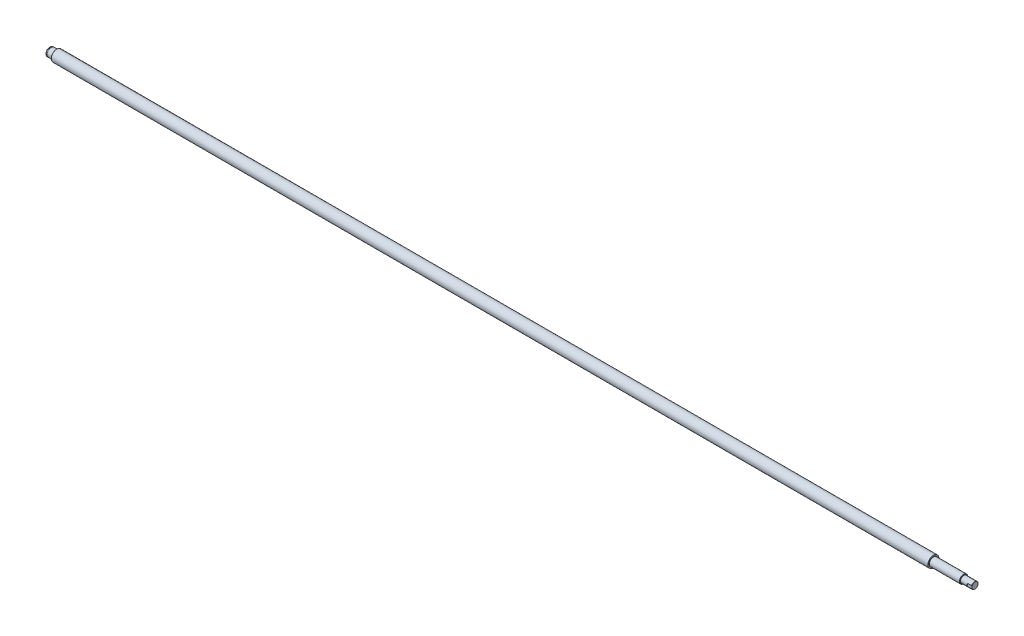
ISO-10303-21;
HEADER;
FILE_DESCRIPTION(('STEP AP214'),'2;1');
FILE_NAME('part.step','',(''),(''),'','','');
FILE_SCHEMA(('AUTOMOTIVE_DESIGN { 1 0 10303 214 1 1 1 1 }'));
ENDSEC;
DATA;
#1=APPLICATION_CONTEXT('core data for automotive mechanical design processes');
#2=APPLICATION_PROTOCOL_DEFINITION('international standard','automotive_design',2000,#1);
#3=PRODUCT_CONTEXT('',#1,'mechanical');
#4=PRODUCT('Part','Part','',(#3));
#5=PRODUCT_RELATED_PRODUCT_CATEGORY('part','',(#4));
#6=PRODUCT_DEFINITION_FORMATION('','',#4);
#7=PRODUCT_DEFINITION_CONTEXT('part definition',#1,'design');
#8=PRODUCT_DEFINITION('design','',#6,#7);
#9=PRODUCT_DEFINITION_SHAPE('','',#8);
#10=(LENGTH_UNIT() NAMED_UNIT(*) SI_UNIT(.MILLI.,.METRE.));
#11=(NAMED_UNIT(*) PLANE_ANGLE_UNIT() SI_UNIT($,.RADIAN.));
#12=(NAMED_UNIT(*) SI_UNIT($,.STERADIAN.) SOLID_ANGLE_UNIT());
#13=UNCERTAINTY_MEASURE_WITH_UNIT(LENGTH_MEASURE(1.E-05),#10,'distance_accuracy_value','');
#14=(GEOMETRIC_REPRESENTATION_CONTEXT(3) GLOBAL_UNCERTAINTY_ASSIGNED_CONTEXT((#13)) GLOBAL_UNIT_ASSIGNED_CONTEXT((#10,
#11,#12)) REPRESENTATION_CONTEXT('',''));
#15=CARTESIAN_POINT('',(0.,0.,0.));
#16=DIRECTION('',(0.,0.,1.));
#17=DIRECTION('',(1.,0.,0.));
#18=AXIS2_PLACEMENT_3D('',#15,#16,#17);
#19=CARTESIAN_POINT('',(0.,3.5,0.));
#20=DIRECTION('',(-1.,0.,0.));
#21=DIRECTION('',(0.,0.,1.));
#22=AXIS2_PLACEMENT_3D('',#19,#20,#21);
#23=PLANE('',#22);
#24=CARTESIAN_POINT('',(0.,0.,0.));
#25=DIRECTION('',(1.,0.,0.));
#26=DIRECTION('',(0.,0.,-1.));
#27=AXIS2_PLACEMENT_3D('',#24,#25,#26);
#28=CIRCLE('',#27,7.);
#29=CARTESIAN_POINT('',(0.,0.,-7.));
#30=VERTEX_POINT('',#29);
#31=EDGE_CURVE('E175',#30,#30,#28,.T.);
#32=ORIENTED_EDGE('',*,*,#31,.F.);
#33=EDGE_LOOP('',(#32));
#34=FACE_BOUND('',#33,.T.);
#35=ADVANCED_FACE('F17',(#34),#23,.T.);
#36=CARTESIAN_POINT('',(0.499999999999999,0.,0.));
#37=DIRECTION('',(1.,0.,0.));
#38=DIRECTION('',(0.,0.,-1.));
#39=AXIS2_PLACEMENT_3D('',#36,#37,#38);
#40=CONICAL_SURFACE('',#39,7.5,0.785398163397448);
#41=ORIENTED_EDGE('',*,*,#31,.T.);
#42=EDGE_LOOP('',(#41));
#43=FACE_BOUND('',#42,.T.);
#44=CARTESIAN_POINT('',(0.5,0.,0.));
#45=DIRECTION('',(1.,0.,0.));
#46=DIRECTION('',(0.,0.,-1.));
#47=AXIS2_PLACEMENT_3D('',#44,#45,#46);
#48=CIRCLE('',#47,7.5);
#49=CARTESIAN_POINT('',(0.5,0.,-7.5));
#50=VERTEX_POINT('',#49);
#51=EDGE_CURVE('E173',#50,#50,#48,.T.);
#52=ORIENTED_EDGE('',*,*,#51,.F.);
#53=EDGE_LOOP('',(#52));
#54=FACE_BOUND('',#53,.T.);
#55=ADVANCED_FACE('F208',(#43,#54),#40,.T.);
#56=CARTESIAN_POINT('',(1.17499999999984,0.,0.));
#57=DIRECTION('',(1.,0.,0.));
#58=DIRECTION('',(0.,0.,-1.));
#59=AXIS2_PLACEMENT_3D('',#56,#57,#58);
#60=CYLINDRICAL_SURFACE('',#59,7.5);
#61=ORIENTED_EDGE('',*,*,#51,.T.);
#62=EDGE_LOOP('',(#61));
#63=FACE_BOUND('',#62,.T.);
#64=CARTESIAN_POINT('',(1.84999999999968,0.,0.));
#65=DIRECTION('',(1.,0.,0.));
#66=DIRECTION('',(0.,0.,-1.));
#67=AXIS2_PLACEMENT_3D('',#64,#65,#66);
#68=CIRCLE('',#67,7.5);
#69=CARTESIAN_POINT('',(1.84999999999968,0.,-7.5));
#70=VERTEX_POINT('',#69);
#71=EDGE_CURVE('E89',#70,#70,#68,.T.);
#72=ORIENTED_EDGE('',*,*,#71,.F.);
#73=EDGE_LOOP('',(#72));
#74=FACE_BOUND('',#73,.T.);
#75=ADVANCED_FACE('F206',(#63,#74),#60,.T.);
#76=CARTESIAN_POINT('',(1670.,2.75,0.));
#77=DIRECTION('',(1.,0.,0.));
#78=DIRECTION('',(0.,0.,-1.));
#79=AXIS2_PLACEMENT_3D('',#76,#77,#78);
#80=PLANE('',#79);
#81=CARTESIAN_POINT('',(1670.00000000007,0.,0.));
#82=DIRECTION('',(-1.,0.,0.));
#83=DIRECTION('',(0.,0.,1.));
#84=AXIS2_PLACEMENT_3D('',#81,#82,#83);
#85=CIRCLE('',#84,5.49999999998363);
#86=CARTESIAN_POINT('',(1670.00000000006,0.,5.49999999999181));
#87=VERTEX_POINT('',#86);
#88=EDGE_CURVE('E73',#87,#87,#85,.T.);
#89=ORIENTED_EDGE('',*,*,#88,.F.);
#90=EDGE_LOOP('',(#89));
#91=FACE_BOUND('',#90,.T.);
#92=ADVANCED_FACE('F201',(#91),#80,.T.);
#93=CARTESIAN_POINT('',(1.84999999999984,7.325,0.));
#94=DIRECTION('',(1.,9.08479640721843E-13,0.));
#95=DIRECTION('',(-9.08479640721843E-13,1.,0.));
#96=AXIS2_PLACEMENT_3D('',#93,#94,#95);
#97=PLANE('',#96);
#98=CARTESIAN_POINT('',(1.85,0.,0.));
#99=DIRECTION('',(1.,0.,0.));
#100=DIRECTION('',(0.,0.,-1.));
#101=AXIS2_PLACEMENT_3D('',#98,#99,#100);
#102=CIRCLE('',#101,7.15);
#103=CARTESIAN_POINT('',(1.85,0.,-7.15));
#104=VERTEX_POINT('',#103);
#105=EDGE_CURVE('E80',#104,#104,#102,.T.);
#106=ORIENTED_EDGE('',*,*,#105,.F.);
#107=EDGE_LOOP('',(#106));
#108=FACE_BOUND('',#107,.T.);
#109=ORIENTED_EDGE('',*,*,#71,.T.);
#110=EDGE_LOOP('',(#109));
#111=FACE_BOUND('',#110,.T.);
#112=ADVANCED_FACE('F197',(#108,#111),#97,.T.);
#113=CARTESIAN_POINT('',(1662.,0.,0.));
#114=DIRECTION('',(1.,0.,0.));
#115=DIRECTION('',(0.,0.,-1.));
#116=AXIS2_PLACEMENT_3D('',#113,#114,#115);
#117=PLANE('',#116);
#118=CARTESIAN_POINT('',(1662.,0.,0.));
#119=DIRECTION('',(1.,0.,0.));
#120=DIRECTION('',(0.,0.,-1.));
#121=AXIS2_PLACEMENT_3D('',#118,#119,#120);
#122=CIRCLE('',#121,6.);
#123=CARTESIAN_POINT('',(1662.,-2.39791576165636,5.5));
#124=VERTEX_POINT('',#123);
#125=CARTESIAN_POINT('',(1662.,2.39791576165636,5.5));
#126=VERTEX_POINT('',#125);
#127=EDGE_CURVE('E170',#124,#126,#122,.F.);
#128=ORIENTED_EDGE('',*,*,#127,.F.);
#129=DIRECTION('',(0.,1.,0.));
#130=VECTOR('',#129,1.);
#131=CARTESIAN_POINT('',(1662.,-6.,5.5));
#132=LINE('',#131,#130);
#133=EDGE_CURVE('E86',#124,#126,#132,.T.);
#134=ORIENTED_EDGE('',*,*,#133,.T.);
#135=EDGE_LOOP('',(#128,#134));
#136=FACE_BOUND('',#135,.T.);
#137=ADVANCED_FACE('F200',(#136),#117,.T.);
#138=CARTESIAN_POINT('',(1670.,-6.,5.5));
#139=DIRECTION('',(0.,0.,-1.));
#140=DIRECTION('',(-1.,0.,0.));
#141=AXIS2_PLACEMENT_3D('',#138,#139,#140);
#142=PLANE('',#141);
#143=CARTESIAN_POINT('',(1670.00000000006,0.,5.5));
#144=CARTESIAN_POINT('',(1670.00000671903,-0.0843667740160233,5.5));
#145=CARTESIAN_POINT('',(1669.99805781873,-0.168720924004849,5.5));
#146=CARTESIAN_POINT('',(1669.99031214151,-0.337239686344565,5.5));
#147=CARTESIAN_POINT('',(1669.98451596158,-0.421404326069411,5.5));
#148=CARTESIAN_POINT('',(1669.96147624779,-0.673126630454653,5.5));
#149=CARTESIAN_POINT('',(1669.93858112064,-0.840195144051697,5.5));
#150=CARTESIAN_POINT('',(1669.87931651562,-1.16963481135854,5.5));
#151=CARTESIAN_POINT('',(1669.84312439648,-1.33203875163859,5.5));
#152=CARTESIAN_POINT('',(1669.75885995465,-1.65372090755589,5.5));
#153=CARTESIAN_POINT('',(1669.71078722857,-1.81299901686102,5.5));
#154=CARTESIAN_POINT('',(1669.63342417195,-2.04237408048594,5.5));
#155=CARTESIAN_POINT('',(1669.60814001963,-2.11385610310426,5.5));
#156=CARTESIAN_POINT('',(1669.55554208815,-2.256317950919,5.5));
#157=CARTESIAN_POINT('',(1669.52822235533,-2.32729558020447,5.5));
#158=CARTESIAN_POINT('',(1669.5000000001,-2.39791576169486,5.5));
#159=B_SPLINE_CURVE_WITH_KNOTS('',3,(#143,#144,#145,#146,#147,#148,#149,#150,#151,#152,#153,
#154,#155,#156,#157,#158),.UNSPECIFIED.,.F.,.F.,(4,2,2,2,2,2,2,4),(0.,0.25305367006106,
0.506068082370128,1.01125269185644,1.50993013110811,2.00862450468305,2.23606855116054,
2.46420611950013),.UNSPECIFIED.);
#160=CARTESIAN_POINT('',(1669.50000000005,-2.39791576167586,5.5));
#161=VERTEX_POINT('',#160);
#162=EDGE_CURVE('E76',#87,#161,#159,.T.);
#163=ORIENTED_EDGE('',*,*,#162,.F.);
#164=CARTESIAN_POINT('',(1669.5000000001,2.39791576168691,5.5));
#165=CARTESIAN_POINT('',(1669.57648819849,2.20666486006152,5.5));
#166=CARTESIAN_POINT('',(1669.64639027461,2.0124300614175,5.5));
#167=CARTESIAN_POINT('',(1669.76916814308,1.62065312983015,5.5));
#168=CARTESIAN_POINT('',(1669.82219438142,1.42315774236156,5.5));
#169=CARTESIAN_POINT('',(1669.88725383458,1.12359700500367,5.5));
#170=CARTESIAN_POINT('',(1669.90653749086,1.02310132018541,5.5));
#171=CARTESIAN_POINT('',(1669.93991481037,0.821248503543999,5.5));
#172=CARTESIAN_POINT('',(1669.95400865385,0.719891401763371,5.5));
#173=CARTESIAN_POINT('',(1669.97682208133,0.515628233018332,5.5));
#174=CARTESIAN_POINT('',(1669.98549115983,0.412716487167826,5.5));
#175=CARTESIAN_POINT('',(1669.9970918312,0.206539189287985,5.5));
#176=CARTESIAN_POINT('',(1670.0000216309,0.103273536776628,5.5));
#177=CARTESIAN_POINT('',(1670.00000000006,0.,5.5));
#178=B_SPLINE_CURVE_WITH_KNOTS('',3,(#164,#165,#166,#167,#168,#169,#170,#171,#172,#173,#174,
#175,#176,#177),.UNSPECIFIED.,.F.,.F.,(4,2,2,2,2,2,4),(0.,0.618334229937417,1.23099075617449,
1.53785513611149,1.84470885750246,2.15437851932269,2.46414491821756),.UNSPECIFIED.);
#179=CARTESIAN_POINT('',(1669.50000000005,2.39791576167164,5.5));
#180=VERTEX_POINT('',#179);
#181=EDGE_CURVE('E78',#180,#87,#178,.T.);
#182=ORIENTED_EDGE('',*,*,#181,.F.);
#183=DIRECTION('',(1.,0.,0.));
#184=VECTOR('',#183,1.);
#185=CARTESIAN_POINT('',(1659.75,2.39791576165636,5.5));
#186=LINE('',#185,#184);
#187=EDGE_CURVE('E167',#126,#180,#186,.T.);
#188=ORIENTED_EDGE('',*,*,#187,.F.);
#189=ORIENTED_EDGE('',*,*,#133,.F.);
#190=DIRECTION('',(1.,0.,0.));
#191=VECTOR('',#190,1.);
#192=CARTESIAN_POINT('',(1659.75,-2.39791576165636,5.5));
#193=LINE('',#192,#191);
#194=EDGE_CURVE('E85',#161,#124,#193,.F.);
#195=ORIENTED_EDGE('',*,*,#194,.F.);
#196=EDGE_LOOP('',(#163,#182,#188,#189,#195));
#197=FACE_BOUND('',#196,.T.);
#198=ADVANCED_FACE('F83',(#197),#142,.F.);
#199=CARTESIAN_POINT('',(1669.50000000008,0.,0.));
#200=DIRECTION('',(-1.,0.,0.));
#201=DIRECTION('',(0.,0.,1.));
#202=AXIS2_PLACEMENT_3D('',#199,#200,#201);
#203=CONICAL_SURFACE('',#202,6.00000000002865,0.785398163454292);
#204=ORIENTED_EDGE('',*,*,#181,.T.);
#205=ORIENTED_EDGE('',*,*,#88,.T.);
#206=ORIENTED_EDGE('',*,*,#162,.T.);
#207=CARTESIAN_POINT('',(1669.5,0.,0.));
#208=DIRECTION('',(1.,0.,0.));
#209=DIRECTION('',(0.,0.,-1.));
#210=AXIS2_PLACEMENT_3D('',#207,#208,#209);
#211=CIRCLE('',#210,6.);
#212=EDGE_CURVE('E67',#180,#161,#211,.F.);
#213=ORIENTED_EDGE('',*,*,#212,.F.);
#214=EDGE_LOOP('',(#204,#205,#206,#213));
#215=FACE_BOUND('',#214,.T.);
#216=ADVANCED_FACE('F75',(#215),#203,.T.);
#217=CARTESIAN_POINT('',(2.425,0.,0.));
#218=DIRECTION('',(1.,0.,0.));
#219=DIRECTION('',(0.,0.,-1.));
#220=AXIS2_PLACEMENT_3D('',#217,#218,#219);
#221=CYLINDRICAL_SURFACE('',#220,7.15);
#222=ORIENTED_EDGE('',*,*,#105,.T.);
#223=EDGE_LOOP('',(#222));
#224=FACE_BOUND('',#223,.T.);
#225=CARTESIAN_POINT('',(3.,0.,0.));
#226=DIRECTION('',(1.,0.,0.));
#227=DIRECTION('',(0.,0.,-1.));
#228=AXIS2_PLACEMENT_3D('',#225,#226,#227);
#229=CIRCLE('',#228,7.15);
#230=CARTESIAN_POINT('',(3.,0.,-7.15));
#231=VERTEX_POINT('',#230);
#232=EDGE_CURVE('E166',#231,#231,#229,.T.);
#233=ORIENTED_EDGE('',*,*,#232,.F.);
#234=EDGE_LOOP('',(#233));
#235=FACE_BOUND('',#234,.T.);
#236=ADVANCED_FACE('F106',(#224,#235),#221,.T.);
#237=CARTESIAN_POINT('',(1659.75,0.,0.));
#238=DIRECTION('',(1.,0.,0.));
#239=DIRECTION('',(0.,0.,-1.));
#240=AXIS2_PLACEMENT_3D('',#237,#238,#239);
#241=CYLINDRICAL_SURFACE('',#240,6.);
#242=CARTESIAN_POINT('',(1650.,0.,0.));
#243=DIRECTION('',(1.,0.,0.));
#244=DIRECTION('',(0.,0.,-1.));
#245=AXIS2_PLACEMENT_3D('',#242,#243,#244);
#246=CIRCLE('',#245,6.);
#247=CARTESIAN_POINT('',(1650.,0.,-6.));
#248=VERTEX_POINT('',#247);
#249=EDGE_CURVE('E186',#248,#248,#246,.F.);
#250=ORIENTED_EDGE('',*,*,#249,.F.);
#251=EDGE_LOOP('',(#250));
#252=FACE_BOUND('',#251,.T.);
#253=ORIENTED_EDGE('',*,*,#187,.T.);
#254=ORIENTED_EDGE('',*,*,#212,.T.);
#255=ORIENTED_EDGE('',*,*,#194,.T.);
#256=ORIENTED_EDGE('',*,*,#127,.T.);
#257=EDGE_LOOP('',(#253,#254,#255,#256));
#258=FACE_BOUND('',#257,.T.);
#259=ADVANCED_FACE('F110',(#252,#258),#241,.T.);
#260=CARTESIAN_POINT('',(2.99999999999989,7.325,0.));
#261=DIRECTION('',(-1.,-6.49639072694949E-13,0.));
#262=DIRECTION('',(6.49639072694949E-13,-1.,0.));
#263=AXIS2_PLACEMENT_3D('',#260,#261,#262);
#264=PLANE('',#263);
#265=CARTESIAN_POINT('',(2.99999999999977,0.,0.));
#266=DIRECTION('',(1.,0.,0.));
#267=DIRECTION('',(0.,0.,-1.));
#268=AXIS2_PLACEMENT_3D('',#265,#266,#267);
#269=CIRCLE('',#268,7.5);
#270=CARTESIAN_POINT('',(2.99999999999977,0.,-7.5));
#271=VERTEX_POINT('',#270);
#272=EDGE_CURVE('E183',#271,#271,#269,.T.);
#273=ORIENTED_EDGE('',*,*,#272,.F.);
#274=EDGE_LOOP('',(#273));
#275=FACE_BOUND('',#274,.T.);
#276=ORIENTED_EDGE('',*,*,#232,.T.);
#277=EDGE_LOOP('',(#276));
#278=FACE_BOUND('',#277,.T.);
#279=ADVANCED_FACE('F114',(#275,#278),#264,.T.);
#280=CARTESIAN_POINT('',(1650.,6.5,0.));
#281=DIRECTION('',(1.,0.,0.));
#282=DIRECTION('',(0.,0.,-1.));
#283=AXIS2_PLACEMENT_3D('',#280,#281,#282);
#284=PLANE('',#283);
#285=ORIENTED_EDGE('',*,*,#249,.T.);
#286=EDGE_LOOP('',(#285));
#287=FACE_BOUND('',#286,.T.);
#288=CARTESIAN_POINT('',(1650.,0.,0.));
#289=DIRECTION('',(-1.,0.,0.));
#290=DIRECTION('',(0.,0.,1.));
#291=AXIS2_PLACEMENT_3D('',#288,#289,#290);
#292=CIRCLE('',#291,6.99999999999992);
#293=CARTESIAN_POINT('',(1650.,0.,6.99999999999991));
#294=VERTEX_POINT('',#293);
#295=EDGE_CURVE('E164',#294,#294,#292,.T.);
#296=ORIENTED_EDGE('',*,*,#295,.F.);
#297=EDGE_LOOP('',(#296));
#298=FACE_BOUND('',#297,.T.);
#299=ADVANCED_FACE('F118',(#287,#298),#284,.T.);
#300=CARTESIAN_POINT('',(7.34999999999989,0.,0.));
#301=DIRECTION('',(1.,0.,0.));
#302=DIRECTION('',(0.,0.,-1.));
#303=AXIS2_PLACEMENT_3D('',#300,#301,#302);
#304=CYLINDRICAL_SURFACE('',#303,7.5);
#305=ORIENTED_EDGE('',*,*,#272,.T.);
#306=EDGE_LOOP('',(#305));
#307=FACE_BOUND('',#306,.T.);
#308=CARTESIAN_POINT('',(11.7,0.,0.));
#309=DIRECTION('',(-1.,0.,0.));
#310=DIRECTION('',(0.,0.,1.));
#311=AXIS2_PLACEMENT_3D('',#308,#309,#310);
#312=CIRCLE('',#311,7.5);
#313=CARTESIAN_POINT('',(11.7,0.,7.5));
#314=VERTEX_POINT('',#313);
#315=EDGE_CURVE('E161',#314,#314,#312,.T.);
#316=ORIENTED_EDGE('',*,*,#315,.T.);
#317=EDGE_LOOP('',(#316));
#318=FACE_BOUND('',#317,.T.);
#319=ADVANCED_FACE('F122',(#307,#318),#304,.T.);
#320=CARTESIAN_POINT('',(1649.5,0.,0.));
#321=DIRECTION('',(-1.,0.,0.));
#322=DIRECTION('',(0.,0.,1.));
#323=AXIS2_PLACEMENT_3D('',#320,#321,#322);
#324=CONICAL_SURFACE('',#323,7.50000000000008,0.78539816339745);
#325=CARTESIAN_POINT('',(1649.5,0.,0.));
#326=DIRECTION('',(1.,0.,0.));
#327=DIRECTION('',(0.,0.,-1.));
#328=AXIS2_PLACEMENT_3D('',#325,#326,#327);
#329=CIRCLE('',#328,7.50000000000003);
#330=CARTESIAN_POINT('',(1649.5,0.,-7.50000000000003));
#331=VERTEX_POINT('',#330);
#332=EDGE_CURVE('E152',#331,#331,#329,.F.);
#333=ORIENTED_EDGE('',*,*,#332,.F.);
#334=EDGE_LOOP('',(#333));
#335=FACE_BOUND('',#334,.T.);
#336=ORIENTED_EDGE('',*,*,#295,.T.);
#337=EDGE_LOOP('',(#336));
#338=FACE_BOUND('',#337,.T.);
#339=ADVANCED_FACE('F126',(#335,#338),#324,.T.);
#340=CARTESIAN_POINT('',(11.7,0.,0.));
#341=DIRECTION('',(-1.,0.,0.));
#342=DIRECTION('',(0.,0.,1.));
#343=AXIS2_PLACEMENT_3D('',#340,#341,#342);
#344=TOROIDAL_SURFACE('',#343,7.8,0.3);
#345=CARTESIAN_POINT('',(12.,0.,0.));
#346=DIRECTION('',(-1.,0.,0.));
#347=DIRECTION('',(0.,0.,-1.));
#348=AXIS2_PLACEMENT_3D('',#345,#346,#347);
#349=CIRCLE('',#348,7.8);
#350=CARTESIAN_POINT('',(12.,0.,7.8));
#351=VERTEX_POINT('',#350);
#352=CARTESIAN_POINT('',(12.,0.,-7.8));
#353=VERTEX_POINT('',#352);
#354=EDGE_CURVE('E147',#351,#353,#349,.F.);
#355=ORIENTED_EDGE('',*,*,#354,.F.);
#356=CARTESIAN_POINT('',(12.,0.,0.));
#357=DIRECTION('',(-1.,0.,0.));
#358=DIRECTION('',(0.,0.,1.));
#359=AXIS2_PLACEMENT_3D('',#356,#357,#358);
#360=CIRCLE('',#359,7.8);
#361=CARTESIAN_POINT('',(12.,7.8,0.));
#362=VERTEX_POINT('',#361);
#363=EDGE_CURVE('E298',#362,#351,#360,.F.);
#364=ORIENTED_EDGE('',*,*,#363,.F.);
#365=CARTESIAN_POINT('',(12.,0.,0.));
#366=DIRECTION('',(-1.,0.,0.));
#367=DIRECTION('',(0.,1.,0.));
#368=AXIS2_PLACEMENT_3D('',#365,#366,#367);
#369=CIRCLE('',#368,7.8);
#370=EDGE_CURVE('E160',#353,#362,#369,.F.);
#371=ORIENTED_EDGE('',*,*,#370,.F.);
#372=EDGE_LOOP('',(#355,#364,#371));
#373=FACE_BOUND('',#372,.T.);
#374=ORIENTED_EDGE('',*,*,#315,.F.);
#375=EDGE_LOOP('',(#374));
#376=FACE_BOUND('',#375,.T.);
#377=ADVANCED_FACE('F129',(#373,#376),#344,.F.);
#378=CARTESIAN_POINT('',(1622.4,0.,0.));
#379=DIRECTION('',(1.,0.,0.));
#380=DIRECTION('',(0.,0.,-1.));
#381=AXIS2_PLACEMENT_3D('',#378,#379,#380);
#382=CYLINDRICAL_SURFACE('',#381,7.50000000000003);
#383=CARTESIAN_POINT('',(1595.3,0.,0.));
#384=DIRECTION('',(-1.,0.,0.));
#385=DIRECTION('',(0.,0.,1.));
#386=AXIS2_PLACEMENT_3D('',#383,#384,#385);
#387=CIRCLE('',#386,7.50000000000005);
#388=CARTESIAN_POINT('',(1595.3,0.,7.50000000000005));
#389=VERTEX_POINT('',#388);
#390=EDGE_CURVE('E144',#389,#389,#387,.F.);
#391=ORIENTED_EDGE('',*,*,#390,.T.);
#392=EDGE_LOOP('',(#391));
#393=FACE_BOUND('',#392,.T.);
#394=ORIENTED_EDGE('',*,*,#332,.T.);
#395=EDGE_LOOP('',(#394));
#396=FACE_BOUND('',#395,.T.);
#397=ADVANCED_FACE('F135',(#393,#396),#382,.T.);
#398=CARTESIAN_POINT('',(12.,8.65,0.));
#399=DIRECTION('',(-1.,0.,0.));
#400=DIRECTION('',(0.,0.,1.));
#401=AXIS2_PLACEMENT_3D('',#398,#399,#400);
#402=PLANE('',#401);
#403=CARTESIAN_POINT('',(12.,0.,0.));
#404=DIRECTION('',(1.,0.,0.));
#405=DIRECTION('',(0.,0.,-1.));
#406=AXIS2_PLACEMENT_3D('',#403,#404,#405);
#407=CIRCLE('',#406,9.5);
#408=CARTESIAN_POINT('',(12.,0.,-9.5));
#409=VERTEX_POINT('',#408);
#410=EDGE_CURVE('E177',#409,#409,#407,.T.);
#411=ORIENTED_EDGE('',*,*,#410,.F.);
#412=EDGE_LOOP('',(#411));
#413=FACE_BOUND('',#412,.T.);
#414=ORIENTED_EDGE('',*,*,#363,.T.);
#415=ORIENTED_EDGE('',*,*,#354,.T.);
#416=ORIENTED_EDGE('',*,*,#370,.T.);
#417=EDGE_LOOP('',(#414,#415,#416));
#418=FACE_BOUND('',#417,.T.);
#419=ADVANCED_FACE('F269',(#413,#418),#402,.T.);
#420=CARTESIAN_POINT('',(1595.3,0.,0.));
#421=DIRECTION('',(-1.,0.,0.));
#422=DIRECTION('',(0.,0.,1.));
#423=AXIS2_PLACEMENT_3D('',#420,#421,#422);
#424=TOROIDAL_SURFACE('',#423,7.79999999999978,0.299999999999727);
#425=CARTESIAN_POINT('',(1595.,0.,0.));
#426=DIRECTION('',(1.,0.,0.));
#427=DIRECTION('',(0.,1.,0.));
#428=AXIS2_PLACEMENT_3D('',#425,#426,#427);
#429=CIRCLE('',#428,7.79999999999989);
#430=CARTESIAN_POINT('',(1595.,0.,7.79999999999993));
#431=VERTEX_POINT('',#430);
#432=CARTESIAN_POINT('',(1595.,7.79999999999997,0.));
#433=VERTEX_POINT('',#432);
#434=EDGE_CURVE('E37',#431,#433,#429,.F.);
#435=ORIENTED_EDGE('',*,*,#434,.F.);
#436=CARTESIAN_POINT('',(1595.,0.,0.));
#437=DIRECTION('',(1.,0.,0.));
#438=DIRECTION('',(0.,0.,1.));
#439=AXIS2_PLACEMENT_3D('',#436,#437,#438);
#440=CIRCLE('',#439,7.79999999999989);
#441=CARTESIAN_POINT('',(1595.,0.,-7.79999999999996));
#442=VERTEX_POINT('',#441);
#443=EDGE_CURVE('E253',#442,#431,#440,.F.);
#444=ORIENTED_EDGE('',*,*,#443,.F.);
#445=CARTESIAN_POINT('',(1595.,0.,0.));
#446=DIRECTION('',(1.,0.,0.));
#447=DIRECTION('',(0.,0.,-1.));
#448=AXIS2_PLACEMENT_3D('',#445,#446,#447);
#449=CIRCLE('',#448,7.8);
#450=EDGE_CURVE('E180',#433,#442,#449,.F.);
#451=ORIENTED_EDGE('',*,*,#450,.F.);
#452=EDGE_LOOP('',(#435,#444,#451));
#453=FACE_BOUND('',#452,.T.);
#454=ORIENTED_EDGE('',*,*,#390,.F.);
#455=EDGE_LOOP('',(#454));
#456=FACE_BOUND('',#455,.T.);
#457=ADVANCED_FACE('F266',(#453,#456),#424,.F.);
#458=CARTESIAN_POINT('',(12.5,0.,0.));
#459=DIRECTION('',(1.,0.,0.));
#460=DIRECTION('',(0.,0.,-1.));
#461=AXIS2_PLACEMENT_3D('',#458,#459,#460);
#462=CONICAL_SURFACE('',#461,10.,0.785398163397448);
#463=ORIENTED_EDGE('',*,*,#410,.T.);
#464=EDGE_LOOP('',(#463));
#465=FACE_BOUND('',#464,.T.);
#466=CARTESIAN_POINT('',(12.5,0.,0.));
#467=DIRECTION('',(1.,0.,0.));
#468=DIRECTION('',(0.,0.,-1.));
#469=AXIS2_PLACEMENT_3D('',#466,#467,#468);
#470=CIRCLE('',#469,10.);
#471=CARTESIAN_POINT('',(12.5,0.,-10.));
#472=VERTEX_POINT('',#471);
#473=EDGE_CURVE('E28',#472,#472,#470,.T.);
#474=ORIENTED_EDGE('',*,*,#473,.F.);
#475=EDGE_LOOP('',(#474));
#476=FACE_BOUND('',#475,.T.);
#477=ADVANCED_FACE('F226',(#465,#476),#462,.T.);
#478=CARTESIAN_POINT('',(1595.,8.9,0.));
#479=DIRECTION('',(1.,0.,0.));
#480=DIRECTION('',(0.,0.,-1.));
#481=AXIS2_PLACEMENT_3D('',#478,#479,#480);
#482=PLANE('',#481);
#483=ORIENTED_EDGE('',*,*,#443,.T.);
#484=ORIENTED_EDGE('',*,*,#434,.T.);
#485=ORIENTED_EDGE('',*,*,#450,.T.);
#486=EDGE_LOOP('',(#483,#484,#485));
#487=FACE_BOUND('',#486,.T.);
#488=CARTESIAN_POINT('',(1595.,0.,0.));
#489=DIRECTION('',(1.,0.,0.));
#490=DIRECTION('',(0.,0.,-1.));
#491=AXIS2_PLACEMENT_3D('',#488,#489,#490);
#492=CIRCLE('',#491,10.);
#493=CARTESIAN_POINT('',(1595.,0.,-10.));
#494=VERTEX_POINT('',#493);
#495=EDGE_CURVE('E11',#494,#494,#492,.F.);
#496=ORIENTED_EDGE('',*,*,#495,.F.);
#497=EDGE_LOOP('',(#496));
#498=FACE_BOUND('',#497,.T.);
#499=ADVANCED_FACE('F220',(#487,#498),#482,.T.);
#500=CARTESIAN_POINT('',(803.75,0.,0.));
#501=DIRECTION('',(1.,0.,0.));
#502=DIRECTION('',(0.,0.,-1.));
#503=AXIS2_PLACEMENT_3D('',#500,#501,#502);
#504=CYLINDRICAL_SURFACE('',#503,10.);
#505=ORIENTED_EDGE('',*,*,#473,.T.);
#506=EDGE_LOOP('',(#505));
#507=FACE_BOUND('',#506,.T.);
#508=ORIENTED_EDGE('',*,*,#495,.T.);
#509=EDGE_LOOP('',(#508));
#510=FACE_BOUND('',#509,.T.);
#511=ADVANCED_FACE('F218',(#507,#510),#504,.T.);
#512=CLOSED_SHELL('',(#35,#55,#75,#92,#112,#137,#198,#216,#236,#259,#279,#299,#319,#339,#377,
#397,#419,#457,#477,#499,#511));
#513=MANIFOLD_SOLID_BREP('B1',#512);
#514=ADVANCED_BREP_SHAPE_REPRESENTATION('',(#18,#513),#14);
#515=SHAPE_DEFINITION_REPRESENTATION(#9,#514);
ENDSEC;
END-ISO-10303-21;
